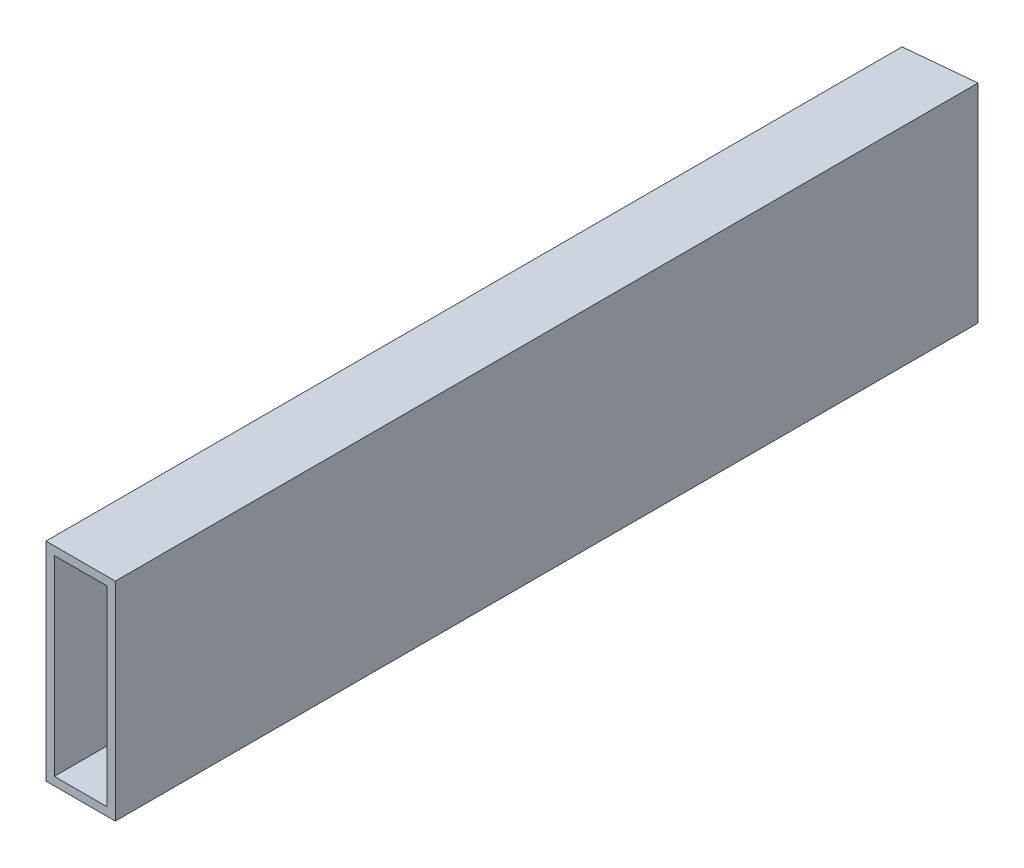
ISO-10303-21;
HEADER;
FILE_DESCRIPTION(('STEP AP214'),'2;1');
FILE_NAME('part.step','',(''),(''),'','','');
FILE_SCHEMA(('AUTOMOTIVE_DESIGN { 1 0 10303 214 1 1 1 1 }'));
ENDSEC;
DATA;
#1=APPLICATION_CONTEXT('core data for automotive mechanical design processes');
#2=APPLICATION_PROTOCOL_DEFINITION('international standard','automotive_design',2000,#1);
#3=PRODUCT_CONTEXT('',#1,'mechanical');
#4=PRODUCT('Part','Part','',(#3));
#5=PRODUCT_RELATED_PRODUCT_CATEGORY('part','',(#4));
#6=PRODUCT_DEFINITION_FORMATION('','',#4);
#7=PRODUCT_DEFINITION_CONTEXT('part definition',#1,'design');
#8=PRODUCT_DEFINITION('design','',#6,#7);
#9=PRODUCT_DEFINITION_SHAPE('','',#8);
#10=(LENGTH_UNIT() NAMED_UNIT(*) SI_UNIT(.MILLI.,.METRE.));
#11=(NAMED_UNIT(*) PLANE_ANGLE_UNIT() SI_UNIT($,.RADIAN.));
#12=(NAMED_UNIT(*) SI_UNIT($,.STERADIAN.) SOLID_ANGLE_UNIT());
#13=UNCERTAINTY_MEASURE_WITH_UNIT(LENGTH_MEASURE(1.E-05),#10,'distance_accuracy_value','');
#14=(GEOMETRIC_REPRESENTATION_CONTEXT(3) GLOBAL_UNCERTAINTY_ASSIGNED_CONTEXT((#13)) GLOBAL_UNIT_ASSIGNED_CONTEXT((#10,
#11,#12)) REPRESENTATION_CONTEXT('',''));
#15=CARTESIAN_POINT('',(0.,0.,0.));
#16=DIRECTION('',(0.,0.,1.));
#17=DIRECTION('',(1.,0.,0.));
#18=AXIS2_PLACEMENT_3D('',#15,#16,#17);
#19=CARTESIAN_POINT('',(12.7000000000001,0.,315.));
#20=DIRECTION('',(-1.,0.,0.));
#21=DIRECTION('',(0.,-1.,0.));
#22=AXIS2_PLACEMENT_3D('',#19,#20,#21);
#23=PLANE('',#22);
#24=DIRECTION('',(0.,0.,-1.));
#25=VECTOR('',#24,1.);
#26=CARTESIAN_POINT('',(12.7,-38.1,315.));
#27=LINE('',#26,#25);
#28=CARTESIAN_POINT('',(12.7,-38.1,315.));
#29=VERTEX_POINT('',#28);
#30=CARTESIAN_POINT('',(12.7,-38.1,-1.21778813519302));
#31=VERTEX_POINT('',#30);
#32=EDGE_CURVE('E120',#29,#31,#27,.T.);
#33=ORIENTED_EDGE('',*,*,#32,.T.);
#34=DIRECTION('',(0.,1.,0.));
#35=VECTOR('',#34,1.);
#36=CARTESIAN_POINT('',(12.7000000000001,0.,-1.21778813519302));
#37=LINE('',#36,#35);
#38=CARTESIAN_POINT('',(12.7,38.1,-1.21778813519307));
#39=VERTEX_POINT('',#38);
#40=EDGE_CURVE('E59',#31,#39,#37,.T.);
#41=ORIENTED_EDGE('',*,*,#40,.T.);
#42=DIRECTION('',(0.,0.,-1.));
#43=VECTOR('',#42,1.);
#44=CARTESIAN_POINT('',(12.7,38.1,315.));
#45=LINE('',#44,#43);
#46=CARTESIAN_POINT('',(12.7,38.1,315.));
#47=VERTEX_POINT('',#46);
#48=EDGE_CURVE('E11',#47,#39,#45,.T.);
#49=ORIENTED_EDGE('',*,*,#48,.F.);
#50=DIRECTION('',(0.,1.,0.));
#51=VECTOR('',#50,1.);
#52=CARTESIAN_POINT('',(12.7000000000001,0.,315.));
#53=LINE('',#52,#51);
#54=EDGE_CURVE('E162',#29,#47,#53,.T.);
#55=ORIENTED_EDGE('',*,*,#54,.F.);
#56=EDGE_LOOP('',(#33,#41,#49,#55));
#57=FACE_BOUND('',#56,.T.);
#58=ADVANCED_FACE('F34',(#57),#23,.F.);
#59=CARTESIAN_POINT('',(0.,38.1,315.));
#60=DIRECTION('',(0.,1.,0.));
#61=DIRECTION('',(0.,0.,1.));
#62=AXIS2_PLACEMENT_3D('',#59,#60,#61);
#63=PLANE('',#62);
#64=DIRECTION('',(0.995434128422968,0.,-0.095451013461394));
#65=VECTOR('',#64,1.);
#66=CARTESIAN_POINT('',(-29.92978686349,38.1,2.86993223080423));
#67=LINE('',#66,#65);
#68=CARTESIAN_POINT('',(-12.7,38.1,1.21778813519302));
#69=VERTEX_POINT('',#68);
#70=EDGE_CURVE('E114',#69,#39,#67,.T.);
#71=ORIENTED_EDGE('',*,*,#70,.F.);
#72=DIRECTION('',(0.,0.,-1.));
#73=VECTOR('',#72,1.);
#74=CARTESIAN_POINT('',(-12.7,38.1,315.));
#75=LINE('',#74,#73);
#76=CARTESIAN_POINT('',(-12.7,38.1,315.));
#77=VERTEX_POINT('',#76);
#78=EDGE_CURVE('E43',#77,#69,#75,.T.);
#79=ORIENTED_EDGE('',*,*,#78,.F.);
#80=DIRECTION('',(1.,0.,0.));
#81=VECTOR('',#80,1.);
#82=CARTESIAN_POINT('',(0.,38.1,315.));
#83=LINE('',#82,#81);
#84=EDGE_CURVE('E164',#77,#47,#83,.T.);
#85=ORIENTED_EDGE('',*,*,#84,.T.);
#86=ORIENTED_EDGE('',*,*,#48,.T.);
#87=EDGE_LOOP('',(#71,#79,#85,#86));
#88=FACE_BOUND('',#87,.T.);
#89=ADVANCED_FACE('F174',(#88),#63,.T.);
#90=CARTESIAN_POINT('',(-12.7,0.,315.));
#91=DIRECTION('',(-1.,0.,0.));
#92=DIRECTION('',(0.,0.,1.));
#93=AXIS2_PLACEMENT_3D('',#90,#91,#92);
#94=PLANE('',#93);
#95=DIRECTION('',(0.,1.,0.));
#96=VECTOR('',#95,1.);
#97=CARTESIAN_POINT('',(-12.7,0.,1.21778813519302));
#98=LINE('',#97,#96);
#99=CARTESIAN_POINT('',(-12.7,-38.1,1.21778813519303));
#100=VERTEX_POINT('',#99);
#101=EDGE_CURVE('E101',#100,#69,#98,.T.);
#102=ORIENTED_EDGE('',*,*,#101,.F.);
#103=DIRECTION('',(0.,0.,-1.));
#104=VECTOR('',#103,1.);
#105=CARTESIAN_POINT('',(-12.7,-38.1,315.));
#106=LINE('',#105,#104);
#107=CARTESIAN_POINT('',(-12.7,-38.1,315.));
#108=VERTEX_POINT('',#107);
#109=EDGE_CURVE('E112',#108,#100,#106,.T.);
#110=ORIENTED_EDGE('',*,*,#109,.F.);
#111=DIRECTION('',(0.,1.,0.));
#112=VECTOR('',#111,1.);
#113=CARTESIAN_POINT('',(-12.7,0.,315.));
#114=LINE('',#113,#112);
#115=EDGE_CURVE('E167',#108,#77,#114,.T.);
#116=ORIENTED_EDGE('',*,*,#115,.T.);
#117=ORIENTED_EDGE('',*,*,#78,.T.);
#118=EDGE_LOOP('',(#102,#110,#116,#117));
#119=FACE_BOUND('',#118,.T.);
#120=ADVANCED_FACE('F110',(#119),#94,.T.);
#121=CARTESIAN_POINT('',(9.652,0.,315.));
#122=DIRECTION('',(1.,0.,0.));
#123=DIRECTION('',(0.,1.,0.));
#124=AXIS2_PLACEMENT_3D('',#121,#122,#123);
#125=PLANE('',#124);
#126=DIRECTION('',(0.,0.,-1.));
#127=VECTOR('',#126,1.);
#128=CARTESIAN_POINT('',(9.65199999999999,35.052,315.));
#129=LINE('',#128,#127);
#130=CARTESIAN_POINT('',(9.65199999999999,35.052,315.));
#131=VERTEX_POINT('',#130);
#132=CARTESIAN_POINT('',(9.65199999999999,35.052,-0.925518982746684));
#133=VERTEX_POINT('',#132);
#134=EDGE_CURVE('E126',#131,#133,#129,.T.);
#135=ORIENTED_EDGE('',*,*,#134,.T.);
#136=DIRECTION('',(0.,-1.,0.));
#137=VECTOR('',#136,1.);
#138=CARTESIAN_POINT('',(9.652,0.,-0.925518982746676));
#139=LINE('',#138,#137);
#140=CARTESIAN_POINT('',(9.652,-35.052,-0.925518982746749));
#141=VERTEX_POINT('',#140);
#142=EDGE_CURVE('E51',#133,#141,#139,.T.);
#143=ORIENTED_EDGE('',*,*,#142,.T.);
#144=DIRECTION('',(0.,0.,-1.));
#145=VECTOR('',#144,1.);
#146=CARTESIAN_POINT('',(9.652,-35.052,315.));
#147=LINE('',#146,#145);
#148=CARTESIAN_POINT('',(9.652,-35.052,315.));
#149=VERTEX_POINT('',#148);
#150=EDGE_CURVE('E38',#149,#141,#147,.T.);
#151=ORIENTED_EDGE('',*,*,#150,.F.);
#152=DIRECTION('',(0.,-1.,0.));
#153=VECTOR('',#152,1.);
#154=CARTESIAN_POINT('',(9.652,0.,315.));
#155=LINE('',#154,#153);
#156=EDGE_CURVE('E147',#131,#149,#155,.T.);
#157=ORIENTED_EDGE('',*,*,#156,.F.);
#158=EDGE_LOOP('',(#135,#143,#151,#157));
#159=FACE_BOUND('',#158,.T.);
#160=ADVANCED_FACE('F36',(#159),#125,.F.);
#161=CARTESIAN_POINT('',(0.,-35.052,315.));
#162=DIRECTION('',(0.,1.,0.));
#163=DIRECTION('',(-1.,0.,0.));
#164=AXIS2_PLACEMENT_3D('',#161,#162,#163);
#165=PLANE('',#164);
#166=DIRECTION('',(0.995434128422968,0.,-0.095451013461394));
#167=VECTOR('',#166,1.);
#168=CARTESIAN_POINT('',(-29.92978686349,-35.052,2.86993223080423));
#169=LINE('',#168,#167);
#170=CARTESIAN_POINT('',(-9.65199999999999,-35.052,0.925518982746675));
#171=VERTEX_POINT('',#170);
#172=EDGE_CURVE('E142',#171,#141,#169,.T.);
#173=ORIENTED_EDGE('',*,*,#172,.F.);
#174=DIRECTION('',(0.,0.,-1.));
#175=VECTOR('',#174,1.);
#176=CARTESIAN_POINT('',(-9.65199999999999,-35.052,315.));
#177=LINE('',#176,#175);
#178=CARTESIAN_POINT('',(-9.65199999999999,-35.052,315.));
#179=VERTEX_POINT('',#178);
#180=EDGE_CURVE('E131',#179,#171,#177,.T.);
#181=ORIENTED_EDGE('',*,*,#180,.F.);
#182=DIRECTION('',(1.,0.,0.));
#183=VECTOR('',#182,1.);
#184=CARTESIAN_POINT('',(0.,-35.052,315.));
#185=LINE('',#184,#183);
#186=EDGE_CURVE('E144',#179,#149,#185,.T.);
#187=ORIENTED_EDGE('',*,*,#186,.T.);
#188=ORIENTED_EDGE('',*,*,#150,.T.);
#189=EDGE_LOOP('',(#173,#181,#187,#188));
#190=FACE_BOUND('',#189,.T.);
#191=ADVANCED_FACE('F141',(#190),#165,.T.);
#192=CARTESIAN_POINT('',(-9.65199999999999,0.,315.));
#193=DIRECTION('',(1.,0.,0.));
#194=DIRECTION('',(0.,1.,0.));
#195=AXIS2_PLACEMENT_3D('',#192,#193,#194);
#196=PLANE('',#195);
#197=DIRECTION('',(0.,-1.,0.));
#198=VECTOR('',#197,1.);
#199=CARTESIAN_POINT('',(-9.65199999999999,0.,0.925518982746676));
#200=LINE('',#199,#198);
#201=CARTESIAN_POINT('',(-9.65199999999999,35.052,0.925518982746656));
#202=VERTEX_POINT('',#201);
#203=EDGE_CURVE('E150',#202,#171,#200,.T.);
#204=ORIENTED_EDGE('',*,*,#203,.F.);
#205=DIRECTION('',(0.,0.,-1.));
#206=VECTOR('',#205,1.);
#207=CARTESIAN_POINT('',(-9.65199999999999,35.052,315.));
#208=LINE('',#207,#206);
#209=CARTESIAN_POINT('',(-9.65199999999999,35.052,315.));
#210=VERTEX_POINT('',#209);
#211=EDGE_CURVE('E129',#210,#202,#208,.T.);
#212=ORIENTED_EDGE('',*,*,#211,.F.);
#213=DIRECTION('',(0.,-1.,0.));
#214=VECTOR('',#213,1.);
#215=CARTESIAN_POINT('',(-9.65199999999999,0.,315.));
#216=LINE('',#215,#214);
#217=EDGE_CURVE('E158',#210,#179,#216,.T.);
#218=ORIENTED_EDGE('',*,*,#217,.T.);
#219=ORIENTED_EDGE('',*,*,#180,.T.);
#220=EDGE_LOOP('',(#204,#212,#218,#219));
#221=FACE_BOUND('',#220,.T.);
#222=ADVANCED_FACE('F187',(#221),#196,.T.);
#223=CARTESIAN_POINT('',(0.,35.052,315.));
#224=DIRECTION('',(0.,1.,0.));
#225=DIRECTION('',(0.,0.,1.));
#226=AXIS2_PLACEMENT_3D('',#223,#224,#225);
#227=PLANE('',#226);
#228=ORIENTED_EDGE('',*,*,#211,.T.);
#229=DIRECTION('',(0.995434128422968,0.,-0.095451013461394));
#230=VECTOR('',#229,1.);
#231=CARTESIAN_POINT('',(-29.92978686349,35.052,2.86993223080423));
#232=LINE('',#231,#230);
#233=EDGE_CURVE('E106',#202,#133,#232,.T.);
#234=ORIENTED_EDGE('',*,*,#233,.T.);
#235=ORIENTED_EDGE('',*,*,#134,.F.);
#236=DIRECTION('',(1.,0.,0.));
#237=VECTOR('',#236,1.);
#238=CARTESIAN_POINT('',(0.,35.052,315.));
#239=LINE('',#238,#237);
#240=EDGE_CURVE('E160',#210,#131,#239,.T.);
#241=ORIENTED_EDGE('',*,*,#240,.F.);
#242=EDGE_LOOP('',(#228,#234,#235,#241));
#243=FACE_BOUND('',#242,.T.);
#244=ADVANCED_FACE('F184',(#243),#227,.F.);
#245=CARTESIAN_POINT('',(0.,-38.1,315.));
#246=DIRECTION('',(0.,-1.,0.));
#247=DIRECTION('',(0.,0.,-1.));
#248=AXIS2_PLACEMENT_3D('',#245,#246,#247);
#249=PLANE('',#248);
#250=DIRECTION('',(0.995434128422968,0.,-0.095451013461394));
#251=VECTOR('',#250,1.);
#252=CARTESIAN_POINT('',(0.,-38.1,0.));
#253=LINE('',#252,#251);
#254=EDGE_CURVE('E98',#100,#31,#253,.T.);
#255=ORIENTED_EDGE('',*,*,#254,.T.);
#256=ORIENTED_EDGE('',*,*,#32,.F.);
#257=DIRECTION('',(-1.,0.,0.));
#258=VECTOR('',#257,1.);
#259=CARTESIAN_POINT('',(0.,-38.1,315.));
#260=LINE('',#259,#258);
#261=EDGE_CURVE('E119',#29,#108,#260,.T.);
#262=ORIENTED_EDGE('',*,*,#261,.T.);
#263=ORIENTED_EDGE('',*,*,#109,.T.);
#264=EDGE_LOOP('',(#255,#256,#262,#263));
#265=FACE_BOUND('',#264,.T.);
#266=ADVANCED_FACE('F117',(#265),#249,.T.);
#267=CARTESIAN_POINT('',(0.,0.,315.));
#268=DIRECTION('',(0.,0.,1.));
#269=DIRECTION('',(1.,0.,0.));
#270=AXIS2_PLACEMENT_3D('',#267,#268,#269);
#271=PLANE('',#270);
#272=ORIENTED_EDGE('',*,*,#156,.T.);
#273=ORIENTED_EDGE('',*,*,#186,.F.);
#274=ORIENTED_EDGE('',*,*,#217,.F.);
#275=ORIENTED_EDGE('',*,*,#240,.T.);
#276=EDGE_LOOP('',(#272,#273,#274,#275));
#277=FACE_BOUND('',#276,.T.);
#278=ORIENTED_EDGE('',*,*,#54,.T.);
#279=ORIENTED_EDGE('',*,*,#84,.F.);
#280=ORIENTED_EDGE('',*,*,#115,.F.);
#281=ORIENTED_EDGE('',*,*,#261,.F.);
#282=EDGE_LOOP('',(#278,#279,#280,#281));
#283=FACE_BOUND('',#282,.T.);
#284=ADVANCED_FACE('F170',(#277,#283),#271,.T.);
#285=CARTESIAN_POINT('',(0.,-38.1,0.));
#286=DIRECTION('',(0.095451013461394,0.,0.995434128422967));
#287=DIRECTION('',(0.995434128422968,0.,-0.095451013461394));
#288=AXIS2_PLACEMENT_3D('',#285,#286,#287);
#289=PLANE('',#288);
#290=ORIENTED_EDGE('',*,*,#233,.F.);
#291=ORIENTED_EDGE('',*,*,#203,.T.);
#292=ORIENTED_EDGE('',*,*,#172,.T.);
#293=ORIENTED_EDGE('',*,*,#142,.F.);
#294=EDGE_LOOP('',(#290,#291,#292,#293));
#295=FACE_BOUND('',#294,.T.);
#296=ORIENTED_EDGE('',*,*,#254,.F.);
#297=ORIENTED_EDGE('',*,*,#101,.T.);
#298=ORIENTED_EDGE('',*,*,#70,.T.);
#299=ORIENTED_EDGE('',*,*,#40,.F.);
#300=EDGE_LOOP('',(#296,#297,#298,#299));
#301=FACE_BOUND('',#300,.T.);
#302=ADVANCED_FACE('F100',(#295,#301),#289,.F.);
#303=CLOSED_SHELL('',(#58,#89,#120,#160,#191,#222,#244,#266,#284,#302));
#304=MANIFOLD_SOLID_BREP('B2',#303);
#305=ADVANCED_BREP_SHAPE_REPRESENTATION('',(#18,#304),#14);
#306=SHAPE_DEFINITION_REPRESENTATION(#9,#305);
ENDSEC;
END-ISO-10303-21;
